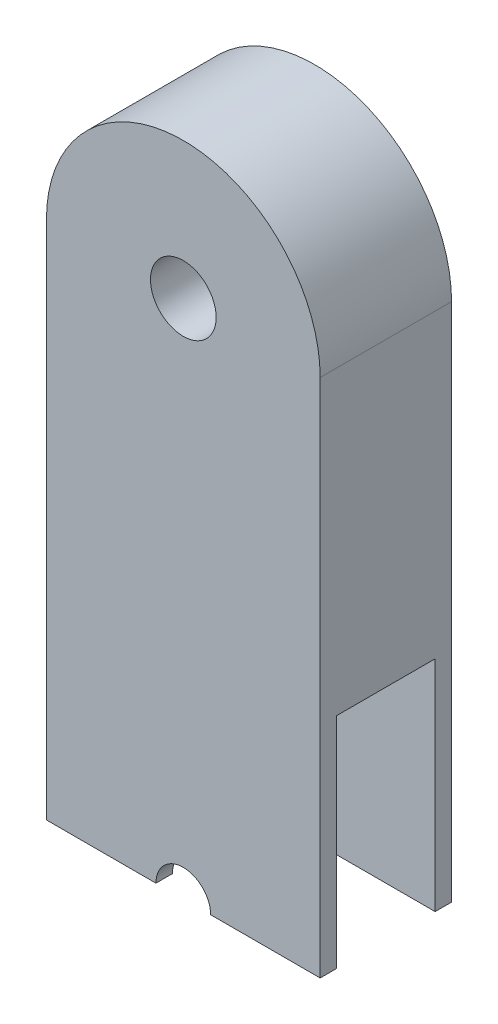
ISO-10303-21;
HEADER;
FILE_DESCRIPTION(('STEP AP214'),'2;1');
FILE_NAME('part.step','',(''),(''),'','','');
FILE_SCHEMA(('AUTOMOTIVE_DESIGN { 1 0 10303 214 1 1 1 1 }'));
ENDSEC;
DATA;
#1=APPLICATION_CONTEXT('core data for automotive mechanical design processes');
#2=APPLICATION_PROTOCOL_DEFINITION('international standard','automotive_design',2000,#1);
#3=PRODUCT_CONTEXT('',#1,'mechanical');
#4=PRODUCT('Part','Part','',(#3));
#5=PRODUCT_RELATED_PRODUCT_CATEGORY('part','',(#4));
#6=PRODUCT_DEFINITION_FORMATION('','',#4);
#7=PRODUCT_DEFINITION_CONTEXT('part definition',#1,'design');
#8=PRODUCT_DEFINITION('design','',#6,#7);
#9=PRODUCT_DEFINITION_SHAPE('','',#8);
#10=(LENGTH_UNIT() NAMED_UNIT(*) SI_UNIT(.MILLI.,.METRE.));
#11=(NAMED_UNIT(*) PLANE_ANGLE_UNIT() SI_UNIT($,.RADIAN.));
#12=(NAMED_UNIT(*) SI_UNIT($,.STERADIAN.) SOLID_ANGLE_UNIT());
#13=UNCERTAINTY_MEASURE_WITH_UNIT(LENGTH_MEASURE(1.E-05),#10,'distance_accuracy_value','');
#14=(GEOMETRIC_REPRESENTATION_CONTEXT(3) GLOBAL_UNCERTAINTY_ASSIGNED_CONTEXT((#13)) GLOBAL_UNIT_ASSIGNED_CONTEXT((#10,
#11,#12)) REPRESENTATION_CONTEXT('',''));
#15=CARTESIAN_POINT('',(0.,0.,0.));
#16=DIRECTION('',(0.,0.,1.));
#17=DIRECTION('',(1.,0.,0.));
#18=AXIS2_PLACEMENT_3D('',#15,#16,#17);
#19=CARTESIAN_POINT('',(50.,0.,0.));
#20=DIRECTION('',(0.,0.,1.));
#21=DIRECTION('',(0.,-1.,0.));
#22=AXIS2_PLACEMENT_3D('',#19,#20,#21);
#23=PLANE('',#22);
#24=CARTESIAN_POINT('',(25.,-25.,0.));
#25=DIRECTION('',(0.,0.,1.));
#26=DIRECTION('',(0.,-1.,0.));
#27=AXIS2_PLACEMENT_3D('',#24,#25,#26);
#28=CIRCLE('',#27,7.00000000000001);
#29=CARTESIAN_POINT('',(25.,-32.,0.));
#30=VERTEX_POINT('',#29);
#31=EDGE_CURVE('E42',#30,#30,#28,.T.);
#32=ORIENTED_EDGE('',*,*,#31,.T.);
#33=EDGE_LOOP('',(#32));
#34=FACE_BOUND('',#33,.T.);
#35=CARTESIAN_POINT('',(25.,-25.,0.));
#36=DIRECTION('',(0.,0.,1.));
#37=DIRECTION('',(0.,-1.,0.));
#38=AXIS2_PLACEMENT_3D('',#35,#36,#37);
#39=CIRCLE('',#38,25.);
#40=CARTESIAN_POINT('',(50.,-25.,0.));
#41=VERTEX_POINT('',#40);
#42=CARTESIAN_POINT('',(0.,-25.,0.));
#43=VERTEX_POINT('',#42);
#44=EDGE_CURVE('E49',#41,#43,#39,.T.);
#45=ORIENTED_EDGE('',*,*,#44,.F.);
#46=DIRECTION('',(0.,1.,0.));
#47=VECTOR('',#46,1.);
#48=CARTESIAN_POINT('',(50.,0.,0.));
#49=LINE('',#48,#47);
#50=CARTESIAN_POINT('',(50.,-120.,0.));
#51=VERTEX_POINT('',#50);
#52=EDGE_CURVE('E154',#51,#41,#49,.T.);
#53=ORIENTED_EDGE('',*,*,#52,.F.);
#54=DIRECTION('',(-1.,0.,0.));
#55=VECTOR('',#54,1.);
#56=CARTESIAN_POINT('',(50.,-120.,0.));
#57=LINE('',#56,#55);
#58=CARTESIAN_POINT('',(30.,-120.,0.));
#59=VERTEX_POINT('',#58);
#60=EDGE_CURVE('E155',#51,#59,#57,.T.);
#61=ORIENTED_EDGE('',*,*,#60,.T.);
#62=CARTESIAN_POINT('',(25.,-120.,0.));
#63=DIRECTION('',(0.,0.,1.));
#64=DIRECTION('',(1.,0.,0.));
#65=AXIS2_PLACEMENT_3D('',#62,#63,#64);
#66=CIRCLE('',#65,5.00000000000001);
#67=CARTESIAN_POINT('',(20.,-120.,0.));
#68=VERTEX_POINT('',#67);
#69=EDGE_CURVE('E262',#59,#68,#66,.T.);
#70=ORIENTED_EDGE('',*,*,#69,.T.);
#71=CARTESIAN_POINT('',(0.,-120.,0.));
#72=VERTEX_POINT('',#71);
#73=EDGE_CURVE('E159',#68,#72,#57,.T.);
#74=ORIENTED_EDGE('',*,*,#73,.T.);
#75=DIRECTION('',(0.,1.,0.));
#76=VECTOR('',#75,1.);
#77=CARTESIAN_POINT('',(0.,0.,0.));
#78=LINE('',#77,#76);
#79=EDGE_CURVE('E147',#72,#43,#78,.T.);
#80=ORIENTED_EDGE('',*,*,#79,.T.);
#81=EDGE_LOOP('',(#45,#53,#61,#70,#74,#80));
#82=FACE_BOUND('',#81,.T.);
#83=ADVANCED_FACE('F34',(#34,#82),#23,.F.);
#84=CARTESIAN_POINT('',(50.,0.,24.));
#85=DIRECTION('',(0.,0.,-1.));
#86=DIRECTION('',(0.,1.,0.));
#87=AXIS2_PLACEMENT_3D('',#84,#85,#86);
#88=PLANE('',#87);
#89=CARTESIAN_POINT('',(25.,-25.,24.));
#90=DIRECTION('',(0.,0.,1.));
#91=DIRECTION('',(1.,0.,0.));
#92=AXIS2_PLACEMENT_3D('',#89,#90,#91);
#93=CIRCLE('',#92,6.00000000000001);
#94=CARTESIAN_POINT('',(31.,-25.,24.));
#95=VERTEX_POINT('',#94);
#96=EDGE_CURVE('E150',#95,#95,#93,.T.);
#97=ORIENTED_EDGE('',*,*,#96,.F.);
#98=EDGE_LOOP('',(#97));
#99=FACE_BOUND('',#98,.T.);
#100=CARTESIAN_POINT('',(25.,-25.,24.));
#101=DIRECTION('',(0.,0.,-1.));
#102=DIRECTION('',(0.,1.,0.));
#103=AXIS2_PLACEMENT_3D('',#100,#101,#102);
#104=CIRCLE('',#103,25.);
#105=CARTESIAN_POINT('',(0.,-25.,24.));
#106=VERTEX_POINT('',#105);
#107=CARTESIAN_POINT('',(50.,-25.,24.));
#108=VERTEX_POINT('',#107);
#109=EDGE_CURVE('E123',#106,#108,#104,.T.);
#110=ORIENTED_EDGE('',*,*,#109,.F.);
#111=DIRECTION('',(0.,-1.,0.));
#112=VECTOR('',#111,1.);
#113=CARTESIAN_POINT('',(0.,0.,24.));
#114=LINE('',#113,#112);
#115=CARTESIAN_POINT('',(0.,-120.,24.));
#116=VERTEX_POINT('',#115);
#117=EDGE_CURVE('E127',#106,#116,#114,.T.);
#118=ORIENTED_EDGE('',*,*,#117,.T.);
#119=DIRECTION('',(-1.,0.,0.));
#120=VECTOR('',#119,1.);
#121=CARTESIAN_POINT('',(50.,-120.,24.));
#122=LINE('',#121,#120);
#123=CARTESIAN_POINT('',(20.,-120.,24.));
#124=VERTEX_POINT('',#123);
#125=EDGE_CURVE('E158',#124,#116,#122,.T.);
#126=ORIENTED_EDGE('',*,*,#125,.F.);
#127=CARTESIAN_POINT('',(25.,-120.,24.));
#128=DIRECTION('',(0.,0.,1.));
#129=DIRECTION('',(1.,0.,0.));
#130=AXIS2_PLACEMENT_3D('',#127,#128,#129);
#131=CIRCLE('',#130,5.00000000000001);
#132=CARTESIAN_POINT('',(30.,-120.,24.));
#133=VERTEX_POINT('',#132);
#134=EDGE_CURVE('E261',#133,#124,#131,.T.);
#135=ORIENTED_EDGE('',*,*,#134,.F.);
#136=CARTESIAN_POINT('',(50.,-120.,24.));
#137=VERTEX_POINT('',#136);
#138=EDGE_CURVE('E160',#137,#133,#122,.T.);
#139=ORIENTED_EDGE('',*,*,#138,.F.);
#140=DIRECTION('',(0.,-1.,0.));
#141=VECTOR('',#140,1.);
#142=CARTESIAN_POINT('',(50.,0.,24.));
#143=LINE('',#142,#141);
#144=EDGE_CURVE('E130',#108,#137,#143,.T.);
#145=ORIENTED_EDGE('',*,*,#144,.F.);
#146=EDGE_LOOP('',(#110,#118,#126,#135,#139,#145));
#147=FACE_BOUND('',#146,.T.);
#148=ADVANCED_FACE('F124',(#99,#147),#88,.F.);
#149=CARTESIAN_POINT('',(50.,0.,0.));
#150=DIRECTION('',(-1.,0.,0.));
#151=DIRECTION('',(0.,0.,1.));
#152=AXIS2_PLACEMENT_3D('',#149,#150,#151);
#153=PLANE('',#152);
#154=DIRECTION('',(0.,0.,-1.));
#155=VECTOR('',#154,1.);
#156=CARTESIAN_POINT('',(50.,-25.,215.496028696607));
#157=LINE('',#156,#155);
#158=EDGE_CURVE('E132',#108,#41,#157,.T.);
#159=ORIENTED_EDGE('',*,*,#158,.F.);
#160=ORIENTED_EDGE('',*,*,#144,.T.);
#161=DIRECTION('',(0.,0.,-1.));
#162=VECTOR('',#161,1.);
#163=CARTESIAN_POINT('',(50.,-120.,0.));
#164=LINE('',#163,#162);
#165=CARTESIAN_POINT('',(50.,-120.,21.));
#166=VERTEX_POINT('',#165);
#167=EDGE_CURVE('E272',#137,#166,#164,.T.);
#168=ORIENTED_EDGE('',*,*,#167,.T.);
#169=DIRECTION('',(0.,-1.,0.));
#170=VECTOR('',#169,1.);
#171=CARTESIAN_POINT('',(50.,-80.,21.));
#172=LINE('',#171,#170);
#173=CARTESIAN_POINT('',(50.,-80.,21.));
#174=VERTEX_POINT('',#173);
#175=EDGE_CURVE('E242',#174,#166,#172,.T.);
#176=ORIENTED_EDGE('',*,*,#175,.F.);
#177=DIRECTION('',(0.,0.,1.));
#178=VECTOR('',#177,1.);
#179=CARTESIAN_POINT('',(50.,-80.,21.));
#180=LINE('',#179,#178);
#181=CARTESIAN_POINT('',(50.,-80.,2.99999999999999));
#182=VERTEX_POINT('',#181);
#183=EDGE_CURVE('E248',#182,#174,#180,.T.);
#184=ORIENTED_EDGE('',*,*,#183,.F.);
#185=DIRECTION('',(0.,1.,0.));
#186=VECTOR('',#185,1.);
#187=CARTESIAN_POINT('',(50.,-80.,2.99999999999999));
#188=LINE('',#187,#186);
#189=CARTESIAN_POINT('',(50.,-120.,2.99999999999999));
#190=VERTEX_POINT('',#189);
#191=EDGE_CURVE('E246',#190,#182,#188,.T.);
#192=ORIENTED_EDGE('',*,*,#191,.F.);
#193=EDGE_CURVE('E271',#190,#51,#164,.T.);
#194=ORIENTED_EDGE('',*,*,#193,.T.);
#195=ORIENTED_EDGE('',*,*,#52,.T.);
#196=EDGE_LOOP('',(#159,#160,#168,#176,#184,#192,#194,#195));
#197=FACE_BOUND('',#196,.T.);
#198=ADVANCED_FACE('F191',(#197),#153,.F.);
#199=CARTESIAN_POINT('',(0.,0.,0.));
#200=DIRECTION('',(-1.,0.,0.));
#201=DIRECTION('',(0.,0.,1.));
#202=AXIS2_PLACEMENT_3D('',#199,#200,#201);
#203=PLANE('',#202);
#204=ORIENTED_EDGE('',*,*,#117,.F.);
#205=DIRECTION('',(0.,0.,-1.));
#206=VECTOR('',#205,1.);
#207=CARTESIAN_POINT('',(0.,-25.,215.496028696607));
#208=LINE('',#207,#206);
#209=EDGE_CURVE('E134',#106,#43,#208,.T.);
#210=ORIENTED_EDGE('',*,*,#209,.T.);
#211=ORIENTED_EDGE('',*,*,#79,.F.);
#212=DIRECTION('',(0.,0.,-1.));
#213=VECTOR('',#212,1.);
#214=CARTESIAN_POINT('',(0.,-120.,0.));
#215=LINE('',#214,#213);
#216=CARTESIAN_POINT('',(0.,-120.,2.99999999999999));
#217=VERTEX_POINT('',#216);
#218=EDGE_CURVE('E146',#217,#72,#215,.T.);
#219=ORIENTED_EDGE('',*,*,#218,.F.);
#220=DIRECTION('',(0.,1.,0.));
#221=VECTOR('',#220,1.);
#222=CARTESIAN_POINT('',(0.,-80.,2.99999999999999));
#223=LINE('',#222,#221);
#224=CARTESIAN_POINT('',(0.,-80.,2.99999999999999));
#225=VERTEX_POINT('',#224);
#226=EDGE_CURVE('E239',#217,#225,#223,.T.);
#227=ORIENTED_EDGE('',*,*,#226,.T.);
#228=DIRECTION('',(0.,0.,1.));
#229=VECTOR('',#228,1.);
#230=CARTESIAN_POINT('',(0.,-80.,21.));
#231=LINE('',#230,#229);
#232=CARTESIAN_POINT('',(0.,-80.,21.));
#233=VERTEX_POINT('',#232);
#234=EDGE_CURVE('E234',#225,#233,#231,.T.);
#235=ORIENTED_EDGE('',*,*,#234,.T.);
#236=DIRECTION('',(0.,-1.,0.));
#237=VECTOR('',#236,1.);
#238=CARTESIAN_POINT('',(0.,-80.,21.));
#239=LINE('',#238,#237);
#240=CARTESIAN_POINT('',(0.,-120.,21.));
#241=VERTEX_POINT('',#240);
#242=EDGE_CURVE('E227',#233,#241,#239,.T.);
#243=ORIENTED_EDGE('',*,*,#242,.T.);
#244=EDGE_CURVE('E145',#116,#241,#215,.T.);
#245=ORIENTED_EDGE('',*,*,#244,.F.);
#246=EDGE_LOOP('',(#204,#210,#211,#219,#227,#235,#243,#245));
#247=FACE_BOUND('',#246,.T.);
#248=ADVANCED_FACE('F142',(#247),#203,.T.);
#249=CARTESIAN_POINT('',(50.,-120.,0.));
#250=DIRECTION('',(0.,1.,0.));
#251=DIRECTION('',(0.,0.,1.));
#252=AXIS2_PLACEMENT_3D('',#249,#250,#251);
#253=PLANE('',#252);
#254=DIRECTION('',(0.,0.,1.));
#255=VECTOR('',#254,1.);
#256=CARTESIAN_POINT('',(20.,-120.,0.));
#257=LINE('',#256,#255);
#258=CARTESIAN_POINT('',(20.,-120.,2.99999999999999));
#259=VERTEX_POINT('',#258);
#260=EDGE_CURVE('E168',#68,#259,#257,.T.);
#261=ORIENTED_EDGE('',*,*,#260,.T.);
#262=DIRECTION('',(-1.,0.,0.));
#263=VECTOR('',#262,1.);
#264=CARTESIAN_POINT('',(50.,-120.,2.99999999999999));
#265=LINE('',#264,#263);
#266=EDGE_CURVE('E258',#259,#217,#265,.T.);
#267=ORIENTED_EDGE('',*,*,#266,.T.);
#268=ORIENTED_EDGE('',*,*,#218,.T.);
#269=ORIENTED_EDGE('',*,*,#73,.F.);
#270=EDGE_LOOP('',(#261,#267,#268,#269));
#271=FACE_BOUND('',#270,.T.);
#272=ADVANCED_FACE('F201',(#271),#253,.F.);
#273=ORIENTED_EDGE('',*,*,#193,.F.);
#274=DIRECTION('',(-1.,0.,0.));
#275=VECTOR('',#274,1.);
#276=CARTESIAN_POINT('',(50.,-120.,2.99999999999999));
#277=LINE('',#276,#275);
#278=CARTESIAN_POINT('',(30.,-120.,2.99999999999999));
#279=VERTEX_POINT('',#278);
#280=EDGE_CURVE('E255',#190,#279,#277,.T.);
#281=ORIENTED_EDGE('',*,*,#280,.T.);
#282=DIRECTION('',(0.,0.,1.));
#283=VECTOR('',#282,1.);
#284=CARTESIAN_POINT('',(30.,-120.,0.));
#285=LINE('',#284,#283);
#286=EDGE_CURVE('E163',#279,#59,#285,.F.);
#287=ORIENTED_EDGE('',*,*,#286,.T.);
#288=ORIENTED_EDGE('',*,*,#60,.F.);
#289=EDGE_LOOP('',(#273,#281,#287,#288));
#290=FACE_BOUND('',#289,.T.);
#291=ADVANCED_FACE('F283',(#290),#253,.F.);
#292=CARTESIAN_POINT('',(25.,-120.,0.));
#293=DIRECTION('',(0.,0.,1.));
#294=DIRECTION('',(1.,0.,0.));
#295=AXIS2_PLACEMENT_3D('',#292,#293,#294);
#296=CYLINDRICAL_SURFACE('',#295,5.00000000000001);
#297=ORIENTED_EDGE('',*,*,#286,.F.);
#298=CARTESIAN_POINT('',(25.,-120.,2.99999999999999));
#299=DIRECTION('',(0.,0.,-1.));
#300=DIRECTION('',(0.,1.,0.));
#301=AXIS2_PLACEMENT_3D('',#298,#299,#300);
#302=CIRCLE('',#301,5.00000000000001);
#303=EDGE_CURVE('E139',#279,#259,#302,.F.);
#304=ORIENTED_EDGE('',*,*,#303,.T.);
#305=ORIENTED_EDGE('',*,*,#260,.F.);
#306=ORIENTED_EDGE('',*,*,#69,.F.);
#307=EDGE_LOOP('',(#297,#304,#305,#306));
#308=FACE_BOUND('',#307,.T.);
#309=ADVANCED_FACE('F215',(#308),#296,.F.);
#310=ORIENTED_EDGE('',*,*,#244,.T.);
#311=DIRECTION('',(1.,0.,0.));
#312=VECTOR('',#311,1.);
#313=CARTESIAN_POINT('',(50.,-120.,21.));
#314=LINE('',#313,#312);
#315=CARTESIAN_POINT('',(20.,-120.,21.));
#316=VERTEX_POINT('',#315);
#317=EDGE_CURVE('E232',#241,#316,#314,.T.);
#318=ORIENTED_EDGE('',*,*,#317,.T.);
#319=EDGE_CURVE('E167',#316,#124,#257,.T.);
#320=ORIENTED_EDGE('',*,*,#319,.T.);
#321=ORIENTED_EDGE('',*,*,#125,.T.);
#322=EDGE_LOOP('',(#310,#318,#320,#321));
#323=FACE_BOUND('',#322,.T.);
#324=ADVANCED_FACE('F199',(#323),#253,.F.);
#325=CARTESIAN_POINT('',(30.,-120.,21.));
#326=VERTEX_POINT('',#325);
#327=EDGE_CURVE('E164',#133,#326,#285,.F.);
#328=ORIENTED_EDGE('',*,*,#327,.T.);
#329=DIRECTION('',(1.,0.,0.));
#330=VECTOR('',#329,1.);
#331=CARTESIAN_POINT('',(50.,-120.,21.));
#332=LINE('',#331,#330);
#333=EDGE_CURVE('E57',#326,#166,#332,.T.);
#334=ORIENTED_EDGE('',*,*,#333,.T.);
#335=ORIENTED_EDGE('',*,*,#167,.F.);
#336=ORIENTED_EDGE('',*,*,#138,.T.);
#337=EDGE_LOOP('',(#328,#334,#335,#336));
#338=FACE_BOUND('',#337,.T.);
#339=ADVANCED_FACE('F195',(#338),#253,.F.);
#340=CARTESIAN_POINT('',(25.,-25.,0.));
#341=DIRECTION('',(0.,0.,1.));
#342=DIRECTION('',(1.,0.,0.));
#343=AXIS2_PLACEMENT_3D('',#340,#341,#342);
#344=CYLINDRICAL_SURFACE('',#343,6.00000000000001);
#345=CARTESIAN_POINT('',(25.,-25.,0.999999999999997));
#346=DIRECTION('',(0.,0.,1.));
#347=DIRECTION('',(0.,-1.,0.));
#348=AXIS2_PLACEMENT_3D('',#345,#346,#347);
#349=CIRCLE('',#348,6.00000000000001);
#350=CARTESIAN_POINT('',(25.,-31.,0.999999999999996));
#351=VERTEX_POINT('',#350);
#352=EDGE_CURVE('E11',#351,#351,#349,.F.);
#353=ORIENTED_EDGE('',*,*,#352,.T.);
#354=EDGE_LOOP('',(#353));
#355=FACE_BOUND('',#354,.T.);
#356=ORIENTED_EDGE('',*,*,#96,.T.);
#357=EDGE_LOOP('',(#356));
#358=FACE_BOUND('',#357,.T.);
#359=ADVANCED_FACE('F198',(#355,#358),#344,.F.);
#360=ORIENTED_EDGE('',*,*,#319,.F.);
#361=CARTESIAN_POINT('',(25.,-120.,21.));
#362=DIRECTION('',(0.,0.,1.));
#363=DIRECTION('',(0.,-1.,0.));
#364=AXIS2_PLACEMENT_3D('',#361,#362,#363);
#365=CIRCLE('',#364,5.00000000000001);
#366=EDGE_CURVE('E171',#316,#326,#365,.F.);
#367=ORIENTED_EDGE('',*,*,#366,.T.);
#368=ORIENTED_EDGE('',*,*,#327,.F.);
#369=ORIENTED_EDGE('',*,*,#134,.T.);
#370=EDGE_LOOP('',(#360,#367,#368,#369));
#371=FACE_BOUND('',#370,.T.);
#372=ADVANCED_FACE('F209',(#371),#296,.F.);
#373=CARTESIAN_POINT('',(0.,-80.,2.99999999999999));
#374=DIRECTION('',(0.,0.,-1.));
#375=DIRECTION('',(0.,1.,0.));
#376=AXIS2_PLACEMENT_3D('',#373,#374,#375);
#377=PLANE('',#376);
#378=ORIENTED_EDGE('',*,*,#303,.F.);
#379=ORIENTED_EDGE('',*,*,#280,.F.);
#380=ORIENTED_EDGE('',*,*,#191,.T.);
#381=DIRECTION('',(1.,0.,0.));
#382=VECTOR('',#381,1.);
#383=CARTESIAN_POINT('',(0.,-80.,2.99999999999999));
#384=LINE('',#383,#382);
#385=EDGE_CURVE('E233',#225,#182,#384,.T.);
#386=ORIENTED_EDGE('',*,*,#385,.F.);
#387=ORIENTED_EDGE('',*,*,#226,.F.);
#388=ORIENTED_EDGE('',*,*,#266,.F.);
#389=EDGE_LOOP('',(#378,#379,#380,#386,#387,#388));
#390=FACE_BOUND('',#389,.T.);
#391=ADVANCED_FACE('F213',(#390),#377,.F.);
#392=CARTESIAN_POINT('',(0.,-80.,21.));
#393=DIRECTION('',(0.,0.,1.));
#394=DIRECTION('',(0.,-1.,0.));
#395=AXIS2_PLACEMENT_3D('',#392,#393,#394);
#396=PLANE('',#395);
#397=ORIENTED_EDGE('',*,*,#242,.F.);
#398=DIRECTION('',(1.,0.,0.));
#399=VECTOR('',#398,1.);
#400=CARTESIAN_POINT('',(0.,-80.,21.));
#401=LINE('',#400,#399);
#402=EDGE_CURVE('E229',#233,#174,#401,.T.);
#403=ORIENTED_EDGE('',*,*,#402,.T.);
#404=ORIENTED_EDGE('',*,*,#175,.T.);
#405=ORIENTED_EDGE('',*,*,#333,.F.);
#406=ORIENTED_EDGE('',*,*,#366,.F.);
#407=ORIENTED_EDGE('',*,*,#317,.F.);
#408=EDGE_LOOP('',(#397,#403,#404,#405,#406,#407));
#409=FACE_BOUND('',#408,.T.);
#410=ADVANCED_FACE('F218',(#409),#396,.F.);
#411=CARTESIAN_POINT('',(0.,-80.,21.));
#412=DIRECTION('',(0.,1.,0.));
#413=DIRECTION('',(0.,0.,1.));
#414=AXIS2_PLACEMENT_3D('',#411,#412,#413);
#415=PLANE('',#414);
#416=ORIENTED_EDGE('',*,*,#183,.T.);
#417=ORIENTED_EDGE('',*,*,#402,.F.);
#418=ORIENTED_EDGE('',*,*,#234,.F.);
#419=ORIENTED_EDGE('',*,*,#385,.T.);
#420=EDGE_LOOP('',(#416,#417,#418,#419));
#421=FACE_BOUND('',#420,.T.);
#422=ADVANCED_FACE('F184',(#421),#415,.F.);
#423=CARTESIAN_POINT('',(25.,-25.,215.496028696607));
#424=DIRECTION('',(0.,0.,-1.));
#425=DIRECTION('',(-1.,0.,0.));
#426=AXIS2_PLACEMENT_3D('',#423,#424,#425);
#427=CYLINDRICAL_SURFACE('',#426,25.);
#428=ORIENTED_EDGE('',*,*,#158,.T.);
#429=ORIENTED_EDGE('',*,*,#44,.T.);
#430=ORIENTED_EDGE('',*,*,#209,.F.);
#431=ORIENTED_EDGE('',*,*,#109,.T.);
#432=EDGE_LOOP('',(#428,#429,#430,#431));
#433=FACE_BOUND('',#432,.T.);
#434=ADVANCED_FACE('F135',(#433),#427,.T.);
#435=CARTESIAN_POINT('',(25.,-25.,0.999999999999997));
#436=DIRECTION('',(0.,0.,1.));
#437=DIRECTION('',(0.,-1.,0.));
#438=AXIS2_PLACEMENT_3D('',#435,#436,#437);
#439=TOROIDAL_SURFACE('',#438,7.00000000000001,1.);
#440=ORIENTED_EDGE('',*,*,#352,.F.);
#441=EDGE_LOOP('',(#440));
#442=FACE_BOUND('',#441,.T.);
#443=ORIENTED_EDGE('',*,*,#31,.F.);
#444=EDGE_LOOP('',(#443));
#445=FACE_BOUND('',#444,.T.);
#446=ADVANCED_FACE('F36',(#442,#445),#439,.T.);
#447=CLOSED_SHELL('',(#83,#148,#198,#248,#272,#291,#309,#324,#339,#359,#372,#391,#410,#422,#434,#446));
#448=MANIFOLD_SOLID_BREP('B2',#447);
#449=ADVANCED_BREP_SHAPE_REPRESENTATION('',(#18,#448),#14);
#450=SHAPE_DEFINITION_REPRESENTATION(#9,#449);
ENDSEC;
END-ISO-10303-21;
